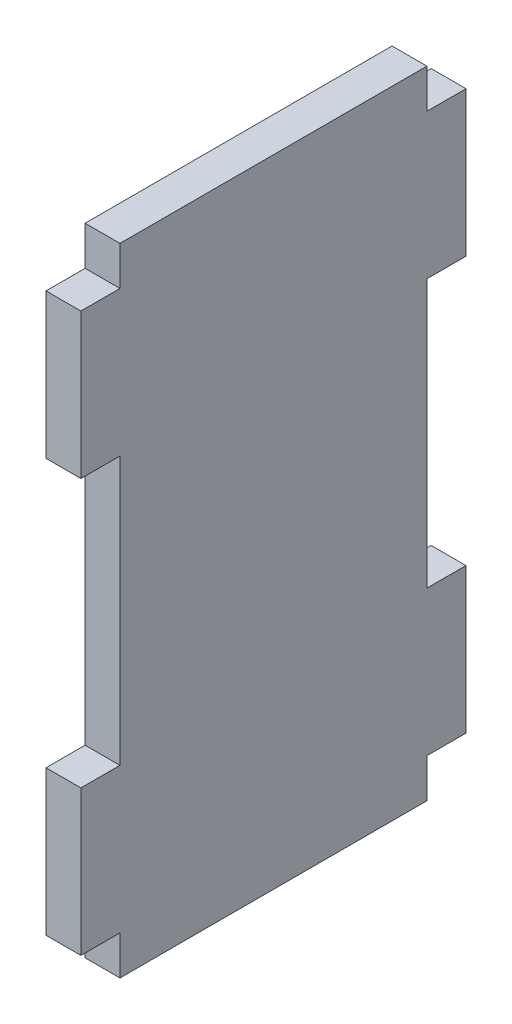
ISO-10303-21;
HEADER;
FILE_DESCRIPTION(('STEP AP214'),'2;1');
FILE_NAME('part.step','',(''),(''),'','','');
FILE_SCHEMA(('AUTOMOTIVE_DESIGN { 1 0 10303 214 1 1 1 1 }'));
ENDSEC;
DATA;
#1=APPLICATION_CONTEXT('core data for automotive mechanical design processes');
#2=APPLICATION_PROTOCOL_DEFINITION('international standard','automotive_design',2000,#1);
#3=PRODUCT_CONTEXT('',#1,'mechanical');
#4=PRODUCT('Part','Part','',(#3));
#5=PRODUCT_RELATED_PRODUCT_CATEGORY('part','',(#4));
#6=PRODUCT_DEFINITION_FORMATION('','',#4);
#7=PRODUCT_DEFINITION_CONTEXT('part definition',#1,'design');
#8=PRODUCT_DEFINITION('design','',#6,#7);
#9=PRODUCT_DEFINITION_SHAPE('','',#8);
#10=(LENGTH_UNIT() NAMED_UNIT(*) SI_UNIT(.MILLI.,.METRE.));
#11=(NAMED_UNIT(*) PLANE_ANGLE_UNIT() SI_UNIT($,.RADIAN.));
#12=(NAMED_UNIT(*) SI_UNIT($,.STERADIAN.) SOLID_ANGLE_UNIT());
#13=UNCERTAINTY_MEASURE_WITH_UNIT(LENGTH_MEASURE(1.E-05),#10,'distance_accuracy_value','');
#14=(GEOMETRIC_REPRESENTATION_CONTEXT(3) GLOBAL_UNCERTAINTY_ASSIGNED_CONTEXT((#13)) GLOBAL_UNIT_ASSIGNED_CONTEXT((#10,
#11,#12)) REPRESENTATION_CONTEXT('',''));
#15=CARTESIAN_POINT('',(0.,0.,0.));
#16=DIRECTION('',(0.,0.,1.));
#17=DIRECTION('',(1.,0.,0.));
#18=AXIS2_PLACEMENT_3D('',#15,#16,#17);
#19=CARTESIAN_POINT('',(25.,246.538461538462,261.692307692308));
#20=DIRECTION('',(0.,0.,-1.));
#21=DIRECTION('',(0.,1.,0.));
#22=AXIS2_PLACEMENT_3D('',#19,#20,#21);
#23=PLANE('',#22);
#24=DIRECTION('',(-1.,0.,0.));
#25=VECTOR('',#24,1.);
#26=CARTESIAN_POINT('',(25.,218.538461538461,261.692307692308));
#27=LINE('',#26,#25);
#28=CARTESIAN_POINT('',(25.,218.538461538461,261.692307692308));
#29=VERTEX_POINT('',#28);
#30=CARTESIAN_POINT('',(0.,218.538461538461,261.692307692308));
#31=VERTEX_POINT('',#30);
#32=EDGE_CURVE('E317',#29,#31,#27,.T.);
#33=ORIENTED_EDGE('',*,*,#32,.T.);
#34=DIRECTION('',(0.,-1.,0.));
#35=VECTOR('',#34,1.);
#36=CARTESIAN_POINT('',(0.,246.538461538462,261.692307692308));
#37=LINE('',#36,#35);
#38=CARTESIAN_POINT('',(0.,114.538461538462,261.692307692308));
#39=VERTEX_POINT('',#38);
#40=EDGE_CURVE('E222',#31,#39,#37,.T.);
#41=ORIENTED_EDGE('',*,*,#40,.T.);
#42=DIRECTION('',(-1.,0.,0.));
#43=VECTOR('',#42,1.);
#44=CARTESIAN_POINT('',(25.,114.538461538462,261.692307692308));
#45=LINE('',#44,#43);
#46=CARTESIAN_POINT('',(25.,114.538461538462,261.692307692308));
#47=VERTEX_POINT('',#46);
#48=EDGE_CURVE('E286',#47,#39,#45,.T.);
#49=ORIENTED_EDGE('',*,*,#48,.F.);
#50=DIRECTION('',(0.,-1.,0.));
#51=VECTOR('',#50,1.);
#52=CARTESIAN_POINT('',(25.,246.538461538462,261.692307692308));
#53=LINE('',#52,#51);
#54=EDGE_CURVE('E214',#29,#47,#53,.T.);
#55=ORIENTED_EDGE('',*,*,#54,.F.);
#56=EDGE_LOOP('',(#33,#41,#49,#55));
#57=FACE_BOUND('',#56,.T.);
#58=ADVANCED_FACE('F39',(#57),#23,.F.);
#59=DIRECTION('',(-1.,0.,0.));
#60=VECTOR('',#59,1.);
#61=CARTESIAN_POINT('',(25.,-77.4615384615385,261.692307692308));
#62=LINE('',#61,#60);
#63=CARTESIAN_POINT('',(25.,-77.4615384615385,261.692307692308));
#64=VERTEX_POINT('',#63);
#65=CARTESIAN_POINT('',(0.,-77.4615384615385,261.692307692308));
#66=VERTEX_POINT('',#65);
#67=EDGE_CURVE('E275',#64,#66,#62,.T.);
#68=ORIENTED_EDGE('',*,*,#67,.T.);
#69=CARTESIAN_POINT('',(0.,-181.461538461538,261.692307692308));
#70=VERTEX_POINT('',#69);
#71=EDGE_CURVE('E218',#66,#70,#37,.T.);
#72=ORIENTED_EDGE('',*,*,#71,.T.);
#73=DIRECTION('',(-1.,0.,0.));
#74=VECTOR('',#73,1.);
#75=CARTESIAN_POINT('',(25.,-181.461538461539,261.692307692308));
#76=LINE('',#75,#74);
#77=CARTESIAN_POINT('',(25.,-181.461538461539,261.692307692308));
#78=VERTEX_POINT('',#77);
#79=EDGE_CURVE('E257',#78,#70,#76,.T.);
#80=ORIENTED_EDGE('',*,*,#79,.F.);
#81=EDGE_CURVE('E238',#64,#78,#53,.T.);
#82=ORIENTED_EDGE('',*,*,#81,.F.);
#83=EDGE_LOOP('',(#68,#72,#80,#82));
#84=FACE_BOUND('',#83,.T.);
#85=ADVANCED_FACE('F439',(#84),#23,.F.);
#86=CARTESIAN_POINT('',(25.,-209.461538461539,261.692307692308));
#87=DIRECTION('',(0.,1.,0.));
#88=DIRECTION('',(0.,0.,1.));
#89=AXIS2_PLACEMENT_3D('',#86,#87,#88);
#90=PLANE('',#89);
#91=DIRECTION('',(-1.,0.,0.));
#92=VECTOR('',#91,1.);
#93=CARTESIAN_POINT('',(25.,-209.461538461538,13.6923076923077));
#94=LINE('',#93,#92);
#95=CARTESIAN_POINT('',(25.,-209.461538461538,13.6923076923077));
#96=VERTEX_POINT('',#95);
#97=CARTESIAN_POINT('',(0.,-209.461538461539,13.6923076923077));
#98=VERTEX_POINT('',#97);
#99=EDGE_CURVE('E56',#96,#98,#94,.T.);
#100=ORIENTED_EDGE('',*,*,#99,.F.);
#101=DIRECTION('',(0.,0.,-1.));
#102=VECTOR('',#101,1.);
#103=CARTESIAN_POINT('',(25.,-209.461538461539,261.692307692308));
#104=LINE('',#103,#102);
#105=CARTESIAN_POINT('',(25.,-209.461538461539,233.692307692308));
#106=VERTEX_POINT('',#105);
#107=EDGE_CURVE('E208',#106,#96,#104,.T.);
#108=ORIENTED_EDGE('',*,*,#107,.F.);
#109=DIRECTION('',(-1.,0.,0.));
#110=VECTOR('',#109,1.);
#111=CARTESIAN_POINT('',(25.,-209.461538461539,233.692307692308));
#112=LINE('',#111,#110);
#113=CARTESIAN_POINT('',(0.,-209.461538461539,233.692307692308));
#114=VERTEX_POINT('',#113);
#115=EDGE_CURVE('E223',#106,#114,#112,.T.);
#116=ORIENTED_EDGE('',*,*,#115,.T.);
#117=DIRECTION('',(0.,0.,-1.));
#118=VECTOR('',#117,1.);
#119=CARTESIAN_POINT('',(0.,-209.461538461539,261.692307692308));
#120=LINE('',#119,#118);
#121=EDGE_CURVE('E224',#114,#98,#120,.T.);
#122=ORIENTED_EDGE('',*,*,#121,.T.);
#123=EDGE_LOOP('',(#100,#108,#116,#122));
#124=FACE_BOUND('',#123,.T.);
#125=ADVANCED_FACE('F451',(#124),#90,.F.);
#126=CARTESIAN_POINT('',(25.,246.538461538462,-14.3076923076922));
#127=DIRECTION('',(0.,0.,1.));
#128=DIRECTION('',(0.,-1.,0.));
#129=AXIS2_PLACEMENT_3D('',#126,#127,#128);
#130=PLANE('',#129);
#131=DIRECTION('',(-1.,0.,0.));
#132=VECTOR('',#131,1.);
#133=CARTESIAN_POINT('',(25.,-181.461538461538,-14.3076923076924));
#134=LINE('',#133,#132);
#135=CARTESIAN_POINT('',(25.,-181.461538461538,-14.3076923076924));
#136=VERTEX_POINT('',#135);
#137=CARTESIAN_POINT('',(0.,-181.461538461538,-14.3076923076924));
#138=VERTEX_POINT('',#137);
#139=EDGE_CURVE('E270',#136,#138,#134,.T.);
#140=ORIENTED_EDGE('',*,*,#139,.T.);
#141=DIRECTION('',(0.,1.,0.));
#142=VECTOR('',#141,1.);
#143=CARTESIAN_POINT('',(0.,246.538461538462,-14.3076923076922));
#144=LINE('',#143,#142);
#145=CARTESIAN_POINT('',(0.,-77.4615384615383,-14.3076923076923));
#146=VERTEX_POINT('',#145);
#147=EDGE_CURVE('E229',#138,#146,#144,.T.);
#148=ORIENTED_EDGE('',*,*,#147,.T.);
#149=DIRECTION('',(-1.,0.,0.));
#150=VECTOR('',#149,1.);
#151=CARTESIAN_POINT('',(25.,-77.4615384615385,-14.3076923076922));
#152=LINE('',#151,#150);
#153=CARTESIAN_POINT('',(25.,-77.4615384615385,-14.3076923076922));
#154=VERTEX_POINT('',#153);
#155=EDGE_CURVE('E379',#154,#146,#152,.T.);
#156=ORIENTED_EDGE('',*,*,#155,.F.);
#157=DIRECTION('',(0.,1.,0.));
#158=VECTOR('',#157,1.);
#159=CARTESIAN_POINT('',(25.,246.538461538462,-14.3076923076922));
#160=LINE('',#159,#158);
#161=EDGE_CURVE('E48',#136,#154,#160,.T.);
#162=ORIENTED_EDGE('',*,*,#161,.F.);
#163=EDGE_LOOP('',(#140,#148,#156,#162));
#164=FACE_BOUND('',#163,.T.);
#165=ADVANCED_FACE('F404',(#164),#130,.F.);
#166=DIRECTION('',(-1.,0.,0.));
#167=VECTOR('',#166,1.);
#168=CARTESIAN_POINT('',(25.,218.538461538462,-14.3076923076922));
#169=LINE('',#168,#167);
#170=CARTESIAN_POINT('',(25.,218.538461538462,-14.3076923076922));
#171=VERTEX_POINT('',#170);
#172=CARTESIAN_POINT('',(0.,218.538461538462,-14.3076923076922));
#173=VERTEX_POINT('',#172);
#174=EDGE_CURVE('E64',#171,#173,#169,.T.);
#175=ORIENTED_EDGE('',*,*,#174,.F.);
#176=CARTESIAN_POINT('',(25.,114.538461538462,-14.3076923076922));
#177=VERTEX_POINT('',#176);
#178=EDGE_CURVE('E200',#177,#171,#160,.T.);
#179=ORIENTED_EDGE('',*,*,#178,.F.);
#180=DIRECTION('',(-1.,0.,0.));
#181=VECTOR('',#180,1.);
#182=CARTESIAN_POINT('',(25.,114.538461538462,-14.3076923076922));
#183=LINE('',#182,#181);
#184=CARTESIAN_POINT('',(0.,114.538461538462,-14.3076923076922));
#185=VERTEX_POINT('',#184);
#186=EDGE_CURVE('E179',#177,#185,#183,.T.);
#187=ORIENTED_EDGE('',*,*,#186,.T.);
#188=EDGE_CURVE('E227',#185,#173,#144,.T.);
#189=ORIENTED_EDGE('',*,*,#188,.T.);
#190=EDGE_LOOP('',(#175,#179,#187,#189));
#191=FACE_BOUND('',#190,.T.);
#192=ADVANCED_FACE('F206',(#191),#130,.F.);
#193=CARTESIAN_POINT('',(25.,246.538461538462,261.692307692308));
#194=DIRECTION('',(0.,-1.,0.));
#195=DIRECTION('',(0.,0.,-1.));
#196=AXIS2_PLACEMENT_3D('',#193,#194,#195);
#197=PLANE('',#196);
#198=DIRECTION('',(-1.,0.,0.));
#199=VECTOR('',#198,1.);
#200=CARTESIAN_POINT('',(25.,246.538461538462,13.6923076923078));
#201=LINE('',#200,#199);
#202=CARTESIAN_POINT('',(25.,246.538461538462,13.6923076923078));
#203=VERTEX_POINT('',#202);
#204=CARTESIAN_POINT('',(0.,246.538461538462,13.6923076923078));
#205=VERTEX_POINT('',#204);
#206=EDGE_CURVE('E334',#203,#205,#201,.T.);
#207=ORIENTED_EDGE('',*,*,#206,.T.);
#208=DIRECTION('',(0.,0.,1.));
#209=VECTOR('',#208,1.);
#210=CARTESIAN_POINT('',(0.,246.538461538462,261.692307692308));
#211=LINE('',#210,#209);
#212=CARTESIAN_POINT('',(0.,246.538461538462,233.692307692308));
#213=VERTEX_POINT('',#212);
#214=EDGE_CURVE('E42',#205,#213,#211,.T.);
#215=ORIENTED_EDGE('',*,*,#214,.T.);
#216=DIRECTION('',(-1.,0.,0.));
#217=VECTOR('',#216,1.);
#218=CARTESIAN_POINT('',(25.,246.538461538461,233.692307692308));
#219=LINE('',#218,#217);
#220=CARTESIAN_POINT('',(25.,246.538461538461,233.692307692308));
#221=VERTEX_POINT('',#220);
#222=EDGE_CURVE('E314',#221,#213,#219,.T.);
#223=ORIENTED_EDGE('',*,*,#222,.F.);
#224=DIRECTION('',(0.,0.,1.));
#225=VECTOR('',#224,1.);
#226=CARTESIAN_POINT('',(25.,246.538461538462,261.692307692308));
#227=LINE('',#226,#225);
#228=EDGE_CURVE('E11',#203,#221,#227,.T.);
#229=ORIENTED_EDGE('',*,*,#228,.F.);
#230=EDGE_LOOP('',(#207,#215,#223,#229));
#231=FACE_BOUND('',#230,.T.);
#232=ADVANCED_FACE('F413',(#231),#197,.F.);
#233=CARTESIAN_POINT('',(25.,0.,0.));
#234=DIRECTION('',(1.,0.,0.));
#235=DIRECTION('',(0.,0.,-1.));
#236=AXIS2_PLACEMENT_3D('',#233,#234,#235);
#237=PLANE('',#236);
#238=DIRECTION('',(0.,-1.,0.));
#239=VECTOR('',#238,1.);
#240=CARTESIAN_POINT('',(25.,-181.461538461538,13.6923076923077));
#241=LINE('',#240,#239);
#242=CARTESIAN_POINT('',(25.,-181.461538461538,13.6923076923077));
#243=VERTEX_POINT('',#242);
#244=EDGE_CURVE('E362',#243,#96,#241,.T.);
#245=ORIENTED_EDGE('',*,*,#244,.F.);
#246=DIRECTION('',(0.,0.,1.));
#247=VECTOR('',#246,1.);
#248=CARTESIAN_POINT('',(25.,-181.461538461538,-14.3076923076924));
#249=LINE('',#248,#247);
#250=EDGE_CURVE('E366',#136,#243,#249,.T.);
#251=ORIENTED_EDGE('',*,*,#250,.F.);
#252=ORIENTED_EDGE('',*,*,#161,.T.);
#253=DIRECTION('',(0.,0.,-1.));
#254=VECTOR('',#253,1.);
#255=CARTESIAN_POINT('',(25.,-77.4615384615385,-14.3076923076922));
#256=LINE('',#255,#254);
#257=CARTESIAN_POINT('',(25.,-77.4615384615385,13.6923076923077));
#258=VERTEX_POINT('',#257);
#259=EDGE_CURVE('E382',#258,#154,#256,.T.);
#260=ORIENTED_EDGE('',*,*,#259,.F.);
#261=DIRECTION('',(0.,-1.,0.));
#262=VECTOR('',#261,1.);
#263=CARTESIAN_POINT('',(25.,114.538461538462,13.6923076923078));
#264=LINE('',#263,#262);
#265=CARTESIAN_POINT('',(25.,114.538461538462,13.6923076923078));
#266=VERTEX_POINT('',#265);
#267=EDGE_CURVE('E202',#266,#258,#264,.T.);
#268=ORIENTED_EDGE('',*,*,#267,.F.);
#269=DIRECTION('',(0.,0.,1.));
#270=VECTOR('',#269,1.);
#271=CARTESIAN_POINT('',(25.,114.538461538462,-14.3076923076922));
#272=LINE('',#271,#270);
#273=EDGE_CURVE('E182',#177,#266,#272,.T.);
#274=ORIENTED_EDGE('',*,*,#273,.F.);
#275=ORIENTED_EDGE('',*,*,#178,.T.);
#276=DIRECTION('',(0.,0.,-1.));
#277=VECTOR('',#276,1.);
#278=CARTESIAN_POINT('',(25.,218.538461538462,-14.3076923076922));
#279=LINE('',#278,#277);
#280=CARTESIAN_POINT('',(25.,218.538461538462,13.6923076923078));
#281=VERTEX_POINT('',#280);
#282=EDGE_CURVE('E343',#281,#171,#279,.T.);
#283=ORIENTED_EDGE('',*,*,#282,.F.);
#284=DIRECTION('',(0.,-1.,0.));
#285=VECTOR('',#284,1.);
#286=CARTESIAN_POINT('',(25.,218.538461538462,13.6923076923078));
#287=LINE('',#286,#285);
#288=EDGE_CURVE('E347',#203,#281,#287,.T.);
#289=ORIENTED_EDGE('',*,*,#288,.F.);
#290=ORIENTED_EDGE('',*,*,#228,.T.);
#291=DIRECTION('',(0.,1.,0.));
#292=VECTOR('',#291,1.);
#293=CARTESIAN_POINT('',(25.,218.538461538461,233.692307692308));
#294=LINE('',#293,#292);
#295=CARTESIAN_POINT('',(25.,218.538461538461,233.692307692308));
#296=VERTEX_POINT('',#295);
#297=EDGE_CURVE('E321',#296,#221,#294,.T.);
#298=ORIENTED_EDGE('',*,*,#297,.F.);
#299=DIRECTION('',(0.,0.,-1.));
#300=VECTOR('',#299,1.);
#301=CARTESIAN_POINT('',(25.,218.538461538461,261.692307692308));
#302=LINE('',#301,#300);
#303=EDGE_CURVE('E326',#29,#296,#302,.T.);
#304=ORIENTED_EDGE('',*,*,#303,.F.);
#305=ORIENTED_EDGE('',*,*,#54,.T.);
#306=DIRECTION('',(0.,0.,1.));
#307=VECTOR('',#306,1.);
#308=CARTESIAN_POINT('',(25.,114.538461538462,261.692307692308));
#309=LINE('',#308,#307);
#310=CARTESIAN_POINT('',(25.,114.538461538462,233.692307692308));
#311=VERTEX_POINT('',#310);
#312=EDGE_CURVE('E289',#311,#47,#309,.T.);
#313=ORIENTED_EDGE('',*,*,#312,.F.);
#314=DIRECTION('',(0.,1.,0.));
#315=VECTOR('',#314,1.);
#316=CARTESIAN_POINT('',(25.,114.538461538462,233.692307692308));
#317=LINE('',#316,#315);
#318=CARTESIAN_POINT('',(25.,-77.4615384615385,233.692307692308));
#319=VERTEX_POINT('',#318);
#320=EDGE_CURVE('E304',#319,#311,#317,.T.);
#321=ORIENTED_EDGE('',*,*,#320,.F.);
#322=DIRECTION('',(0.,0.,-1.));
#323=VECTOR('',#322,1.);
#324=CARTESIAN_POINT('',(25.,-77.4615384615385,261.692307692308));
#325=LINE('',#324,#323);
#326=EDGE_CURVE('E294',#64,#319,#325,.T.);
#327=ORIENTED_EDGE('',*,*,#326,.F.);
#328=ORIENTED_EDGE('',*,*,#81,.T.);
#329=DIRECTION('',(0.,0.,1.));
#330=VECTOR('',#329,1.);
#331=CARTESIAN_POINT('',(25.,-181.461538461539,261.692307692308));
#332=LINE('',#331,#330);
#333=CARTESIAN_POINT('',(25.,-181.461538461539,233.692307692308));
#334=VERTEX_POINT('',#333);
#335=EDGE_CURVE('E260',#334,#78,#332,.T.);
#336=ORIENTED_EDGE('',*,*,#335,.F.);
#337=DIRECTION('',(0.,1.,0.));
#338=VECTOR('',#337,1.);
#339=CARTESIAN_POINT('',(25.,-181.461538461539,233.692307692308));
#340=LINE('',#339,#338);
#341=EDGE_CURVE('E265',#106,#334,#340,.T.);
#342=ORIENTED_EDGE('',*,*,#341,.F.);
#343=ORIENTED_EDGE('',*,*,#107,.T.);
#344=EDGE_LOOP('',(#245,#251,#252,#260,#268,#274,#275,#283,#289,#290,#298,#304,#305,#313,#321,
#327,#328,#336,#342,#343));
#345=FACE_BOUND('',#344,.T.);
#346=ADVANCED_FACE('F198',(#345),#237,.T.);
#347=CARTESIAN_POINT('',(0.,0.,0.));
#348=DIRECTION('',(1.,0.,0.));
#349=DIRECTION('',(0.,0.,-1.));
#350=AXIS2_PLACEMENT_3D('',#347,#348,#349);
#351=PLANE('',#350);
#352=DIRECTION('',(0.,0.,1.));
#353=VECTOR('',#352,1.);
#354=CARTESIAN_POINT('',(0.,-181.461538461538,-14.3076923076924));
#355=LINE('',#354,#353);
#356=CARTESIAN_POINT('',(0.,-181.461538461538,13.6923076923077));
#357=VERTEX_POINT('',#356);
#358=EDGE_CURVE('E337',#138,#357,#355,.T.);
#359=ORIENTED_EDGE('',*,*,#358,.T.);
#360=DIRECTION('',(0.,-1.,0.));
#361=VECTOR('',#360,1.);
#362=CARTESIAN_POINT('',(0.,-181.461538461538,13.6923076923077));
#363=LINE('',#362,#361);
#364=EDGE_CURVE('E363',#357,#98,#363,.T.);
#365=ORIENTED_EDGE('',*,*,#364,.T.);
#366=ORIENTED_EDGE('',*,*,#121,.F.);
#367=DIRECTION('',(0.,1.,0.));
#368=VECTOR('',#367,1.);
#369=CARTESIAN_POINT('',(0.,-181.461538461539,233.692307692308));
#370=LINE('',#369,#368);
#371=CARTESIAN_POINT('',(0.,-181.461538461539,233.692307692308));
#372=VERTEX_POINT('',#371);
#373=EDGE_CURVE('E266',#114,#372,#370,.T.);
#374=ORIENTED_EDGE('',*,*,#373,.T.);
#375=DIRECTION('',(0.,0.,1.));
#376=VECTOR('',#375,1.);
#377=CARTESIAN_POINT('',(0.,-181.461538461539,261.692307692308));
#378=LINE('',#377,#376);
#379=EDGE_CURVE('E261',#372,#70,#378,.T.);
#380=ORIENTED_EDGE('',*,*,#379,.T.);
#381=ORIENTED_EDGE('',*,*,#71,.F.);
#382=DIRECTION('',(0.,0.,-1.));
#383=VECTOR('',#382,1.);
#384=CARTESIAN_POINT('',(0.,-77.4615384615385,261.692307692308));
#385=LINE('',#384,#383);
#386=CARTESIAN_POINT('',(0.,-77.4615384615385,233.692307692308));
#387=VERTEX_POINT('',#386);
#388=EDGE_CURVE('E191',#66,#387,#385,.T.);
#389=ORIENTED_EDGE('',*,*,#388,.T.);
#390=DIRECTION('',(0.,1.,0.));
#391=VECTOR('',#390,1.);
#392=CARTESIAN_POINT('',(0.,114.538461538462,233.692307692308));
#393=LINE('',#392,#391);
#394=CARTESIAN_POINT('',(0.,114.538461538462,233.692307692308));
#395=VERTEX_POINT('',#394);
#396=EDGE_CURVE('E295',#387,#395,#393,.T.);
#397=ORIENTED_EDGE('',*,*,#396,.T.);
#398=DIRECTION('',(0.,0.,1.));
#399=VECTOR('',#398,1.);
#400=CARTESIAN_POINT('',(0.,114.538461538462,261.692307692308));
#401=LINE('',#400,#399);
#402=EDGE_CURVE('E290',#395,#39,#401,.T.);
#403=ORIENTED_EDGE('',*,*,#402,.T.);
#404=ORIENTED_EDGE('',*,*,#40,.F.);
#405=DIRECTION('',(0.,0.,-1.));
#406=VECTOR('',#405,1.);
#407=CARTESIAN_POINT('',(0.,218.538461538461,261.692307692308));
#408=LINE('',#407,#406);
#409=CARTESIAN_POINT('',(0.,218.538461538461,233.692307692308));
#410=VERTEX_POINT('',#409);
#411=EDGE_CURVE('E279',#31,#410,#408,.T.);
#412=ORIENTED_EDGE('',*,*,#411,.T.);
#413=DIRECTION('',(0.,1.,0.));
#414=VECTOR('',#413,1.);
#415=CARTESIAN_POINT('',(0.,218.538461538461,233.692307692308));
#416=LINE('',#415,#414);
#417=EDGE_CURVE('E322',#410,#213,#416,.T.);
#418=ORIENTED_EDGE('',*,*,#417,.T.);
#419=ORIENTED_EDGE('',*,*,#214,.F.);
#420=DIRECTION('',(0.,-1.,0.));
#421=VECTOR('',#420,1.);
#422=CARTESIAN_POINT('',(0.,218.538461538462,13.6923076923078));
#423=LINE('',#422,#421);
#424=CARTESIAN_POINT('',(0.,218.538461538462,13.6923076923078));
#425=VERTEX_POINT('',#424);
#426=EDGE_CURVE('E313',#205,#425,#423,.T.);
#427=ORIENTED_EDGE('',*,*,#426,.T.);
#428=DIRECTION('',(0.,0.,-1.));
#429=VECTOR('',#428,1.);
#430=CARTESIAN_POINT('',(0.,218.538461538462,-14.3076923076922));
#431=LINE('',#430,#429);
#432=EDGE_CURVE('E344',#425,#173,#431,.T.);
#433=ORIENTED_EDGE('',*,*,#432,.T.);
#434=ORIENTED_EDGE('',*,*,#188,.F.);
#435=DIRECTION('',(0.,0.,1.));
#436=VECTOR('',#435,1.);
#437=CARTESIAN_POINT('',(0.,114.538461538462,-14.3076923076922));
#438=LINE('',#437,#436);
#439=CARTESIAN_POINT('',(0.,114.538461538462,13.6923076923078));
#440=VERTEX_POINT('',#439);
#441=EDGE_CURVE('E185',#185,#440,#438,.T.);
#442=ORIENTED_EDGE('',*,*,#441,.T.);
#443=DIRECTION('',(0.,-1.,0.));
#444=VECTOR('',#443,1.);
#445=CARTESIAN_POINT('',(0.,114.538461538462,13.6923076923078));
#446=LINE('',#445,#444);
#447=CARTESIAN_POINT('',(0.,-77.4615384615385,13.6923076923077));
#448=VERTEX_POINT('',#447);
#449=EDGE_CURVE('E386',#440,#448,#446,.T.);
#450=ORIENTED_EDGE('',*,*,#449,.T.);
#451=DIRECTION('',(0.,0.,-1.));
#452=VECTOR('',#451,1.);
#453=CARTESIAN_POINT('',(0.,-77.4615384615385,-14.3076923076922));
#454=LINE('',#453,#452);
#455=EDGE_CURVE('E204',#448,#146,#454,.T.);
#456=ORIENTED_EDGE('',*,*,#455,.T.);
#457=ORIENTED_EDGE('',*,*,#147,.F.);
#458=EDGE_LOOP('',(#359,#365,#366,#374,#380,#381,#389,#397,#403,#404,#412,#418,#419,#427,#433,
#434,#442,#450,#456,#457));
#459=FACE_BOUND('',#458,.T.);
#460=ADVANCED_FACE('F406',(#459),#351,.F.);
#461=CARTESIAN_POINT('',(25.,-181.461538461539,233.692307692308));
#462=DIRECTION('',(0.,0.,1.));
#463=DIRECTION('',(1.,0.,0.));
#464=AXIS2_PLACEMENT_3D('',#461,#462,#463);
#465=PLANE('',#464);
#466=ORIENTED_EDGE('',*,*,#373,.F.);
#467=ORIENTED_EDGE('',*,*,#115,.F.);
#468=ORIENTED_EDGE('',*,*,#341,.T.);
#469=DIRECTION('',(-1.,0.,0.));
#470=VECTOR('',#469,1.);
#471=CARTESIAN_POINT('',(25.,-181.461538461539,233.692307692308));
#472=LINE('',#471,#470);
#473=EDGE_CURVE('E254',#334,#372,#472,.T.);
#474=ORIENTED_EDGE('',*,*,#473,.T.);
#475=EDGE_LOOP('',(#466,#467,#468,#474));
#476=FACE_BOUND('',#475,.T.);
#477=ADVANCED_FACE('F447',(#476),#465,.T.);
#478=CARTESIAN_POINT('',(25.,-181.461538461539,261.692307692308));
#479=DIRECTION('',(0.,-1.,0.));
#480=DIRECTION('',(0.,0.,-1.));
#481=AXIS2_PLACEMENT_3D('',#478,#479,#480);
#482=PLANE('',#481);
#483=ORIENTED_EDGE('',*,*,#379,.F.);
#484=ORIENTED_EDGE('',*,*,#473,.F.);
#485=ORIENTED_EDGE('',*,*,#335,.T.);
#486=ORIENTED_EDGE('',*,*,#79,.T.);
#487=EDGE_LOOP('',(#483,#484,#485,#486));
#488=FACE_BOUND('',#487,.T.);
#489=ADVANCED_FACE('F443',(#488),#482,.T.);
#490=CARTESIAN_POINT('',(25.,114.538461538462,-14.3076923076922));
#491=DIRECTION('',(0.,-1.,0.));
#492=DIRECTION('',(0.,0.,-1.));
#493=AXIS2_PLACEMENT_3D('',#490,#491,#492);
#494=PLANE('',#493);
#495=ORIENTED_EDGE('',*,*,#441,.F.);
#496=ORIENTED_EDGE('',*,*,#186,.F.);
#497=ORIENTED_EDGE('',*,*,#273,.T.);
#498=DIRECTION('',(-1.,0.,0.));
#499=VECTOR('',#498,1.);
#500=CARTESIAN_POINT('',(25.,114.538461538462,13.6923076923078));
#501=LINE('',#500,#499);
#502=EDGE_CURVE('E192',#266,#440,#501,.T.);
#503=ORIENTED_EDGE('',*,*,#502,.T.);
#504=EDGE_LOOP('',(#495,#496,#497,#503));
#505=FACE_BOUND('',#504,.T.);
#506=ADVANCED_FACE('F181',(#505),#494,.T.);
#507=CARTESIAN_POINT('',(25.,114.538461538462,13.6923076923078));
#508=DIRECTION('',(0.,0.,-1.));
#509=DIRECTION('',(0.,1.,0.));
#510=AXIS2_PLACEMENT_3D('',#507,#508,#509);
#511=PLANE('',#510);
#512=ORIENTED_EDGE('',*,*,#449,.F.);
#513=ORIENTED_EDGE('',*,*,#502,.F.);
#514=ORIENTED_EDGE('',*,*,#267,.T.);
#515=DIRECTION('',(-1.,0.,0.));
#516=VECTOR('',#515,1.);
#517=CARTESIAN_POINT('',(25.,-77.4615384615385,13.6923076923077));
#518=LINE('',#517,#516);
#519=EDGE_CURVE('E376',#258,#448,#518,.T.);
#520=ORIENTED_EDGE('',*,*,#519,.T.);
#521=EDGE_LOOP('',(#512,#513,#514,#520));
#522=FACE_BOUND('',#521,.T.);
#523=ADVANCED_FACE('F398',(#522),#511,.T.);
#524=CARTESIAN_POINT('',(25.,-77.4615384615385,-14.3076923076922));
#525=DIRECTION('',(0.,1.,0.));
#526=DIRECTION('',(0.,0.,1.));
#527=AXIS2_PLACEMENT_3D('',#524,#525,#526);
#528=PLANE('',#527);
#529=ORIENTED_EDGE('',*,*,#455,.F.);
#530=ORIENTED_EDGE('',*,*,#519,.F.);
#531=ORIENTED_EDGE('',*,*,#259,.T.);
#532=ORIENTED_EDGE('',*,*,#155,.T.);
#533=EDGE_LOOP('',(#529,#530,#531,#532));
#534=FACE_BOUND('',#533,.T.);
#535=ADVANCED_FACE('F401',(#534),#528,.T.);
#536=CARTESIAN_POINT('',(25.,-77.4615384615385,261.692307692308));
#537=DIRECTION('',(0.,1.,0.));
#538=DIRECTION('',(0.,0.,1.));
#539=AXIS2_PLACEMENT_3D('',#536,#537,#538);
#540=PLANE('',#539);
#541=ORIENTED_EDGE('',*,*,#388,.F.);
#542=ORIENTED_EDGE('',*,*,#67,.F.);
#543=ORIENTED_EDGE('',*,*,#326,.T.);
#544=DIRECTION('',(-1.,0.,0.));
#545=VECTOR('',#544,1.);
#546=CARTESIAN_POINT('',(25.,-77.4615384615385,233.692307692308));
#547=LINE('',#546,#545);
#548=EDGE_CURVE('E280',#319,#387,#547,.T.);
#549=ORIENTED_EDGE('',*,*,#548,.T.);
#550=EDGE_LOOP('',(#541,#542,#543,#549));
#551=FACE_BOUND('',#550,.T.);
#552=ADVANCED_FACE('F436',(#551),#540,.T.);
#553=CARTESIAN_POINT('',(25.,114.538461538462,233.692307692308));
#554=DIRECTION('',(0.,0.,1.));
#555=DIRECTION('',(0.,-1.,0.));
#556=AXIS2_PLACEMENT_3D('',#553,#554,#555);
#557=PLANE('',#556);
#558=ORIENTED_EDGE('',*,*,#396,.F.);
#559=ORIENTED_EDGE('',*,*,#548,.F.);
#560=ORIENTED_EDGE('',*,*,#320,.T.);
#561=DIRECTION('',(-1.,0.,0.));
#562=VECTOR('',#561,1.);
#563=CARTESIAN_POINT('',(25.,114.538461538462,233.692307692308));
#564=LINE('',#563,#562);
#565=EDGE_CURVE('E283',#311,#395,#564,.T.);
#566=ORIENTED_EDGE('',*,*,#565,.T.);
#567=EDGE_LOOP('',(#558,#559,#560,#566));
#568=FACE_BOUND('',#567,.T.);
#569=ADVANCED_FACE('F433',(#568),#557,.T.);
#570=CARTESIAN_POINT('',(25.,114.538461538462,261.692307692308));
#571=DIRECTION('',(0.,-1.,0.));
#572=DIRECTION('',(0.,0.,-1.));
#573=AXIS2_PLACEMENT_3D('',#570,#571,#572);
#574=PLANE('',#573);
#575=ORIENTED_EDGE('',*,*,#402,.F.);
#576=ORIENTED_EDGE('',*,*,#565,.F.);
#577=ORIENTED_EDGE('',*,*,#312,.T.);
#578=ORIENTED_EDGE('',*,*,#48,.T.);
#579=EDGE_LOOP('',(#575,#576,#577,#578));
#580=FACE_BOUND('',#579,.T.);
#581=ADVANCED_FACE('F430',(#580),#574,.T.);
#582=CARTESIAN_POINT('',(25.,218.538461538461,261.692307692308));
#583=DIRECTION('',(0.,1.,0.));
#584=DIRECTION('',(0.,0.,1.));
#585=AXIS2_PLACEMENT_3D('',#582,#583,#584);
#586=PLANE('',#585);
#587=ORIENTED_EDGE('',*,*,#411,.F.);
#588=ORIENTED_EDGE('',*,*,#32,.F.);
#589=ORIENTED_EDGE('',*,*,#303,.T.);
#590=DIRECTION('',(-1.,0.,0.));
#591=VECTOR('',#590,1.);
#592=CARTESIAN_POINT('',(25.,218.538461538461,233.692307692308));
#593=LINE('',#592,#591);
#594=EDGE_CURVE('E309',#296,#410,#593,.T.);
#595=ORIENTED_EDGE('',*,*,#594,.T.);
#596=EDGE_LOOP('',(#587,#588,#589,#595));
#597=FACE_BOUND('',#596,.T.);
#598=ADVANCED_FACE('F420',(#597),#586,.T.);
#599=CARTESIAN_POINT('',(25.,218.538461538461,233.692307692308));
#600=DIRECTION('',(0.,0.,1.));
#601=DIRECTION('',(1.,0.,0.));
#602=AXIS2_PLACEMENT_3D('',#599,#600,#601);
#603=PLANE('',#602);
#604=ORIENTED_EDGE('',*,*,#417,.F.);
#605=ORIENTED_EDGE('',*,*,#594,.F.);
#606=ORIENTED_EDGE('',*,*,#297,.T.);
#607=ORIENTED_EDGE('',*,*,#222,.T.);
#608=EDGE_LOOP('',(#604,#605,#606,#607));
#609=FACE_BOUND('',#608,.T.);
#610=ADVANCED_FACE('F415',(#609),#603,.T.);
#611=CARTESIAN_POINT('',(25.,218.538461538462,13.6923076923078));
#612=DIRECTION('',(0.,0.,-1.));
#613=DIRECTION('',(-1.,0.,0.));
#614=AXIS2_PLACEMENT_3D('',#611,#612,#613);
#615=PLANE('',#614);
#616=ORIENTED_EDGE('',*,*,#426,.F.);
#617=ORIENTED_EDGE('',*,*,#206,.F.);
#618=ORIENTED_EDGE('',*,*,#288,.T.);
#619=DIRECTION('',(-1.,0.,0.));
#620=VECTOR('',#619,1.);
#621=CARTESIAN_POINT('',(25.,218.538461538462,13.6923076923078));
#622=LINE('',#621,#620);
#623=EDGE_CURVE('E338',#281,#425,#622,.T.);
#624=ORIENTED_EDGE('',*,*,#623,.T.);
#625=EDGE_LOOP('',(#616,#617,#618,#624));
#626=FACE_BOUND('',#625,.T.);
#627=ADVANCED_FACE('F463',(#626),#615,.T.);
#628=CARTESIAN_POINT('',(25.,218.538461538462,-14.3076923076922));
#629=DIRECTION('',(0.,1.,0.));
#630=DIRECTION('',(0.,0.,1.));
#631=AXIS2_PLACEMENT_3D('',#628,#629,#630);
#632=PLANE('',#631);
#633=ORIENTED_EDGE('',*,*,#432,.F.);
#634=ORIENTED_EDGE('',*,*,#623,.F.);
#635=ORIENTED_EDGE('',*,*,#282,.T.);
#636=ORIENTED_EDGE('',*,*,#174,.T.);
#637=EDGE_LOOP('',(#633,#634,#635,#636));
#638=FACE_BOUND('',#637,.T.);
#639=ADVANCED_FACE('F408',(#638),#632,.T.);
#640=CARTESIAN_POINT('',(25.,-181.461538461538,-14.3076923076924));
#641=DIRECTION('',(0.,-1.,0.));
#642=DIRECTION('',(0.,0.,-1.));
#643=AXIS2_PLACEMENT_3D('',#640,#641,#642);
#644=PLANE('',#643);
#645=ORIENTED_EDGE('',*,*,#358,.F.);
#646=ORIENTED_EDGE('',*,*,#139,.F.);
#647=ORIENTED_EDGE('',*,*,#250,.T.);
#648=DIRECTION('',(-1.,0.,0.));
#649=VECTOR('',#648,1.);
#650=CARTESIAN_POINT('',(25.,-181.461538461538,13.6923076923077));
#651=LINE('',#650,#649);
#652=EDGE_CURVE('E357',#243,#357,#651,.T.);
#653=ORIENTED_EDGE('',*,*,#652,.T.);
#654=EDGE_LOOP('',(#645,#646,#647,#653));
#655=FACE_BOUND('',#654,.T.);
#656=ADVANCED_FACE('F455',(#655),#644,.T.);
#657=CARTESIAN_POINT('',(25.,-181.461538461538,13.6923076923077));
#658=DIRECTION('',(0.,0.,-1.));
#659=DIRECTION('',(-1.,0.,0.));
#660=AXIS2_PLACEMENT_3D('',#657,#658,#659);
#661=PLANE('',#660);
#662=ORIENTED_EDGE('',*,*,#364,.F.);
#663=ORIENTED_EDGE('',*,*,#652,.F.);
#664=ORIENTED_EDGE('',*,*,#244,.T.);
#665=ORIENTED_EDGE('',*,*,#99,.T.);
#666=EDGE_LOOP('',(#662,#663,#664,#665));
#667=FACE_BOUND('',#666,.T.);
#668=ADVANCED_FACE('F453',(#667),#661,.T.);
#669=CLOSED_SHELL('',(#58,#85,#125,#165,#192,#232,#346,#460,#477,#489,#506,#523,#535,#552,#569,
#581,#598,#610,#627,#639,#656,#668));
#670=MANIFOLD_SOLID_BREP('B2',#669);
#671=ADVANCED_BREP_SHAPE_REPRESENTATION('',(#18,#670),#14);
#672=SHAPE_DEFINITION_REPRESENTATION(#9,#671);
ENDSEC;
END-ISO-10303-21;
